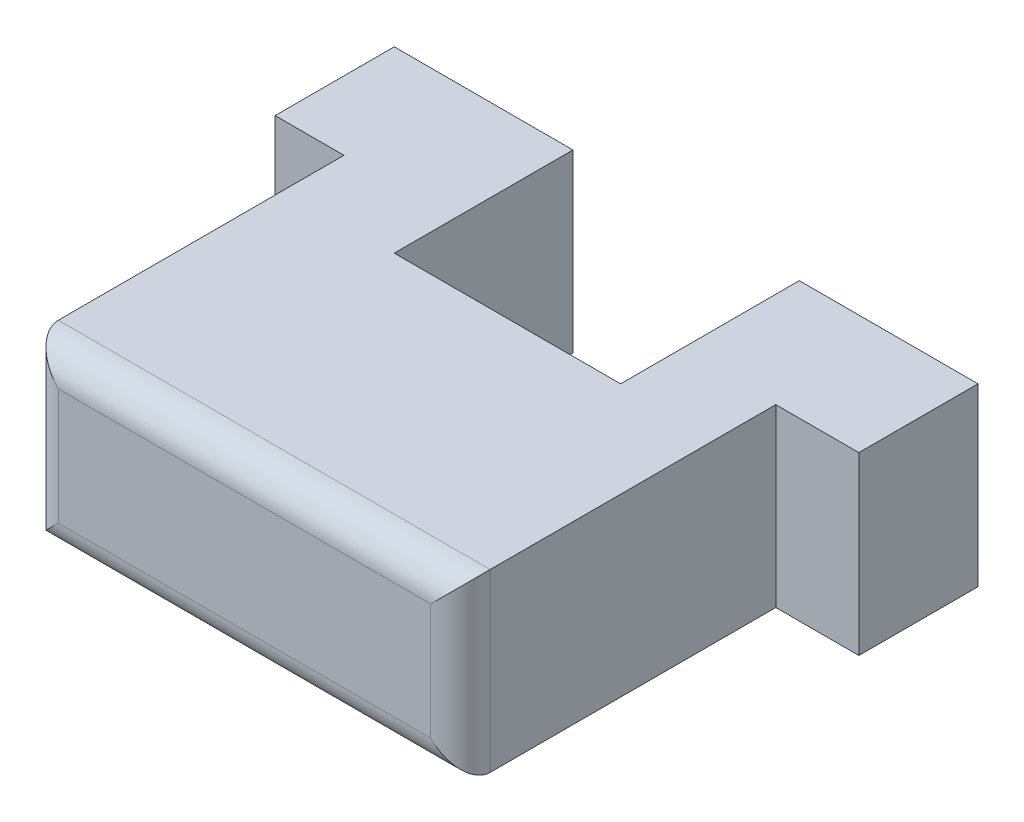
ISO-10303-21;
HEADER;
FILE_DESCRIPTION(('STEP AP214'),'2;1');
FILE_NAME('part.step','',(''),(''),'','','');
FILE_SCHEMA(('AUTOMOTIVE_DESIGN { 1 0 10303 214 1 1 1 1 }'));
ENDSEC;
DATA;
#1=APPLICATION_CONTEXT('core data for automotive mechanical design processes');
#2=APPLICATION_PROTOCOL_DEFINITION('international standard','automotive_design',2000,#1);
#3=PRODUCT_CONTEXT('',#1,'mechanical');
#4=PRODUCT('Part','Part','',(#3));
#5=PRODUCT_RELATED_PRODUCT_CATEGORY('part','',(#4));
#6=PRODUCT_DEFINITION_FORMATION('','',#4);
#7=PRODUCT_DEFINITION_CONTEXT('part definition',#1,'design');
#8=PRODUCT_DEFINITION('design','',#6,#7);
#9=PRODUCT_DEFINITION_SHAPE('','',#8);
#10=(LENGTH_UNIT() NAMED_UNIT(*) SI_UNIT(.MILLI.,.METRE.));
#11=(NAMED_UNIT(*) PLANE_ANGLE_UNIT() SI_UNIT($,.RADIAN.));
#12=(NAMED_UNIT(*) SI_UNIT($,.STERADIAN.) SOLID_ANGLE_UNIT());
#13=UNCERTAINTY_MEASURE_WITH_UNIT(LENGTH_MEASURE(1.E-05),#10,'distance_accuracy_value','');
#14=(GEOMETRIC_REPRESENTATION_CONTEXT(3) GLOBAL_UNCERTAINTY_ASSIGNED_CONTEXT((#13)) GLOBAL_UNIT_ASSIGNED_CONTEXT((#10,
#11,#12)) REPRESENTATION_CONTEXT('',''));
#15=CARTESIAN_POINT('',(0.,0.,0.));
#16=DIRECTION('',(0.,0.,1.));
#17=DIRECTION('',(1.,0.,0.));
#18=AXIS2_PLACEMENT_3D('',#15,#16,#17);
#19=CARTESIAN_POINT('',(6.25,0.,7.59));
#20=DIRECTION('',(0.,1.,0.));
#21=DIRECTION('',(0.,0.,1.));
#22=AXIS2_PLACEMENT_3D('',#19,#20,#21);
#23=CYLINDRICAL_SURFACE('',#22,1.);
#24=CARTESIAN_POINT('',(6.25,1.95,7.59));
#25=DIRECTION('',(-0.707106781186547,0.707106781186547,0.));
#26=DIRECTION('',(-0.707106781186547,-0.707106781186547,0.));
#27=AXIS2_PLACEMENT_3D('',#24,#25,#26);
#28=ELLIPSE('',#27,1.41421356237309,1.);
#29=CARTESIAN_POINT('',(6.25,1.95,8.59));
#30=VERTEX_POINT('',#29);
#31=CARTESIAN_POINT('',(7.25,2.95,7.59));
#32=VERTEX_POINT('',#31);
#33=EDGE_CURVE('E11',#30,#32,#28,.T.);
#34=ORIENTED_EDGE('',*,*,#33,.F.);
#35=DIRECTION('',(0.,1.,0.));
#36=VECTOR('',#35,1.);
#37=CARTESIAN_POINT('',(6.25,0.,8.59));
#38=LINE('',#37,#36);
#39=CARTESIAN_POINT('',(6.25,-1.95,8.59));
#40=VERTEX_POINT('',#39);
#41=EDGE_CURVE('E237',#40,#30,#38,.T.);
#42=ORIENTED_EDGE('',*,*,#41,.F.);
#43=CARTESIAN_POINT('',(6.25,-1.95,7.59));
#44=DIRECTION('',(0.707106781186547,0.707106781186547,0.));
#45=DIRECTION('',(-0.707106781186547,0.707106781186547,0.));
#46=AXIS2_PLACEMENT_3D('',#43,#44,#45);
#47=ELLIPSE('',#46,1.41421356237309,1.);
#48=CARTESIAN_POINT('',(7.25,-2.95,7.59));
#49=VERTEX_POINT('',#48);
#50=EDGE_CURVE('E39',#40,#49,#47,.T.);
#51=ORIENTED_EDGE('',*,*,#50,.T.);
#52=DIRECTION('',(0.,1.,0.));
#53=VECTOR('',#52,1.);
#54=CARTESIAN_POINT('',(7.25,2.95,7.59));
#55=LINE('',#54,#53);
#56=EDGE_CURVE('E260',#32,#49,#55,.F.);
#57=ORIENTED_EDGE('',*,*,#56,.F.);
#58=EDGE_LOOP('',(#34,#42,#51,#57));
#59=FACE_BOUND('',#58,.T.);
#60=ADVANCED_FACE('F32',(#59),#23,.T.);
#61=CARTESIAN_POINT('',(0.,-1.95,7.59));
#62=DIRECTION('',(-1.,0.,0.));
#63=DIRECTION('',(0.,0.,1.));
#64=AXIS2_PLACEMENT_3D('',#61,#62,#63);
#65=CYLINDRICAL_SURFACE('',#64,1.);
#66=ORIENTED_EDGE('',*,*,#50,.F.);
#67=DIRECTION('',(1.,0.,0.));
#68=VECTOR('',#67,1.);
#69=CARTESIAN_POINT('',(0.,-1.95,8.59));
#70=LINE('',#69,#68);
#71=CARTESIAN_POINT('',(-6.25,-1.95,8.59));
#72=VERTEX_POINT('',#71);
#73=EDGE_CURVE('E241',#72,#40,#70,.T.);
#74=ORIENTED_EDGE('',*,*,#73,.F.);
#75=CARTESIAN_POINT('',(-6.25,-1.95,7.59));
#76=DIRECTION('',(-0.707106781186547,0.707106781186547,0.));
#77=DIRECTION('',(-0.707106781186547,-0.707106781186547,0.));
#78=AXIS2_PLACEMENT_3D('',#75,#76,#77);
#79=ELLIPSE('',#78,1.41421356237309,1.);
#80=CARTESIAN_POINT('',(-7.25,-2.95,7.59));
#81=VERTEX_POINT('',#80);
#82=EDGE_CURVE('E53',#72,#81,#79,.F.);
#83=ORIENTED_EDGE('',*,*,#82,.T.);
#84=DIRECTION('',(1.,0.,0.));
#85=VECTOR('',#84,1.);
#86=CARTESIAN_POINT('',(0.,-2.95,7.59));
#87=LINE('',#86,#85);
#88=EDGE_CURVE('E258',#49,#81,#87,.F.);
#89=ORIENTED_EDGE('',*,*,#88,.F.);
#90=EDGE_LOOP('',(#66,#74,#83,#89));
#91=FACE_BOUND('',#90,.T.);
#92=ADVANCED_FACE('F307',(#91),#65,.T.);
#93=CARTESIAN_POINT('',(-6.25,0.,7.59));
#94=DIRECTION('',(0.,1.,0.));
#95=DIRECTION('',(0.,0.,1.));
#96=AXIS2_PLACEMENT_3D('',#93,#94,#95);
#97=CYLINDRICAL_SURFACE('',#96,1.);
#98=ORIENTED_EDGE('',*,*,#82,.F.);
#99=DIRECTION('',(0.,-1.,0.));
#100=VECTOR('',#99,1.);
#101=CARTESIAN_POINT('',(-6.25,0.,8.59));
#102=LINE('',#101,#100);
#103=CARTESIAN_POINT('',(-6.25,1.95,8.59));
#104=VERTEX_POINT('',#103);
#105=EDGE_CURVE('E245',#104,#72,#102,.T.);
#106=ORIENTED_EDGE('',*,*,#105,.F.);
#107=CARTESIAN_POINT('',(-6.25,1.95,7.59));
#108=DIRECTION('',(0.707106781186547,0.707106781186547,0.));
#109=DIRECTION('',(-0.707106781186547,0.707106781186547,0.));
#110=AXIS2_PLACEMENT_3D('',#107,#108,#109);
#111=ELLIPSE('',#110,1.41421356237309,1.);
#112=CARTESIAN_POINT('',(-7.25,2.95,7.59));
#113=VERTEX_POINT('',#112);
#114=EDGE_CURVE('E262',#104,#113,#111,.F.);
#115=ORIENTED_EDGE('',*,*,#114,.T.);
#116=DIRECTION('',(0.,-1.,0.));
#117=VECTOR('',#116,1.);
#118=CARTESIAN_POINT('',(-7.25,0.,7.59));
#119=LINE('',#118,#117);
#120=EDGE_CURVE('E255',#81,#113,#119,.F.);
#121=ORIENTED_EDGE('',*,*,#120,.F.);
#122=EDGE_LOOP('',(#98,#106,#115,#121));
#123=FACE_BOUND('',#122,.T.);
#124=ADVANCED_FACE('F267',(#123),#97,.T.);
#125=CARTESIAN_POINT('',(0.,1.95,7.59));
#126=DIRECTION('',(-1.,0.,0.));
#127=DIRECTION('',(0.,0.,1.));
#128=AXIS2_PLACEMENT_3D('',#125,#126,#127);
#129=CYLINDRICAL_SURFACE('',#128,1.);
#130=DIRECTION('',(-1.,0.,0.));
#131=VECTOR('',#130,1.);
#132=CARTESIAN_POINT('',(0.,1.95,8.59));
#133=LINE('',#132,#131);
#134=EDGE_CURVE('E250',#30,#104,#133,.T.);
#135=ORIENTED_EDGE('',*,*,#134,.F.);
#136=ORIENTED_EDGE('',*,*,#33,.T.);
#137=DIRECTION('',(-1.,0.,0.));
#138=VECTOR('',#137,1.);
#139=CARTESIAN_POINT('',(-7.25,2.95,7.59));
#140=LINE('',#139,#138);
#141=EDGE_CURVE('E252',#113,#32,#140,.F.);
#142=ORIENTED_EDGE('',*,*,#141,.F.);
#143=ORIENTED_EDGE('',*,*,#114,.F.);
#144=EDGE_LOOP('',(#135,#136,#142,#143));
#145=FACE_BOUND('',#144,.T.);
#146=ADVANCED_FACE('F274',(#145),#129,.T.);
#147=CARTESIAN_POINT('',(0.,0.,0.));
#148=DIRECTION('',(0.,0.,1.));
#149=DIRECTION('',(1.,0.,0.));
#150=AXIS2_PLACEMENT_3D('',#147,#148,#149);
#151=PLANE('',#150);
#152=DIRECTION('',(0.,-1.,0.));
#153=VECTOR('',#152,1.);
#154=CARTESIAN_POINT('',(-3.56007381756422,2.95,0.));
#155=LINE('',#154,#153);
#156=CARTESIAN_POINT('',(-3.56007381756422,2.95,0.));
#157=VERTEX_POINT('',#156);
#158=CARTESIAN_POINT('',(-3.56007381756423,-2.95,0.));
#159=VERTEX_POINT('',#158);
#160=EDGE_CURVE('E140',#157,#159,#155,.T.);
#161=ORIENTED_EDGE('',*,*,#160,.F.);
#162=DIRECTION('',(1.,0.,0.));
#163=VECTOR('',#162,1.);
#164=CARTESIAN_POINT('',(-7.25,2.95,0.));
#165=LINE('',#164,#163);
#166=CARTESIAN_POINT('',(4.03992618243578,2.95,0.));
#167=VERTEX_POINT('',#166);
#168=EDGE_CURVE('E226',#157,#167,#165,.T.);
#169=ORIENTED_EDGE('',*,*,#168,.T.);
#170=DIRECTION('',(0.,1.,0.));
#171=VECTOR('',#170,1.);
#172=CARTESIAN_POINT('',(4.03992618243578,2.95,0.));
#173=LINE('',#172,#171);
#174=CARTESIAN_POINT('',(4.03992618243577,-2.95,0.));
#175=VERTEX_POINT('',#174);
#176=EDGE_CURVE('E201',#175,#167,#173,.T.);
#177=ORIENTED_EDGE('',*,*,#176,.F.);
#178=DIRECTION('',(1.,0.,0.));
#179=VECTOR('',#178,1.);
#180=CARTESIAN_POINT('',(-7.25,-2.95,0.));
#181=LINE('',#180,#179);
#182=EDGE_CURVE('E223',#159,#175,#181,.T.);
#183=ORIENTED_EDGE('',*,*,#182,.F.);
#184=EDGE_LOOP('',(#161,#169,#177,#183));
#185=FACE_BOUND('',#184,.T.);
#186=ADVANCED_FACE('F289',(#185),#151,.F.);
#187=CARTESIAN_POINT('',(-7.25,2.95,2.59));
#188=DIRECTION('',(1.,0.,0.));
#189=DIRECTION('',(0.,0.,-1.));
#190=AXIS2_PLACEMENT_3D('',#187,#188,#189);
#191=PLANE('',#190);
#192=DIRECTION('',(0.,0.,-1.));
#193=VECTOR('',#192,1.);
#194=CARTESIAN_POINT('',(-7.25,-2.95,2.59));
#195=LINE('',#194,#193);
#196=CARTESIAN_POINT('',(-7.25,-2.95,-2.));
#197=VERTEX_POINT('',#196);
#198=EDGE_CURVE('E214',#81,#197,#195,.T.);
#199=ORIENTED_EDGE('',*,*,#198,.F.);
#200=ORIENTED_EDGE('',*,*,#120,.T.);
#201=DIRECTION('',(0.,0.,-1.));
#202=VECTOR('',#201,1.);
#203=CARTESIAN_POINT('',(-7.25,2.95,2.59));
#204=LINE('',#203,#202);
#205=CARTESIAN_POINT('',(-7.25,2.95,-2.));
#206=VERTEX_POINT('',#205);
#207=EDGE_CURVE('E228',#113,#206,#204,.T.);
#208=ORIENTED_EDGE('',*,*,#207,.T.);
#209=DIRECTION('',(0.,1.,0.));
#210=VECTOR('',#209,1.);
#211=CARTESIAN_POINT('',(-7.25,2.95,-2.));
#212=LINE('',#211,#210);
#213=EDGE_CURVE('E143',#197,#206,#212,.T.);
#214=ORIENTED_EDGE('',*,*,#213,.F.);
#215=EDGE_LOOP('',(#199,#200,#208,#214));
#216=FACE_BOUND('',#215,.T.);
#217=ADVANCED_FACE('F272',(#216),#191,.F.);
#218=CARTESIAN_POINT('',(-7.25,-2.95,2.59));
#219=DIRECTION('',(0.,1.,0.));
#220=DIRECTION('',(0.,0.,1.));
#221=AXIS2_PLACEMENT_3D('',#218,#219,#220);
#222=PLANE('',#221);
#223=DIRECTION('',(0.,0.,-1.));
#224=VECTOR('',#223,1.);
#225=CARTESIAN_POINT('',(7.25,-2.95,2.59));
#226=LINE('',#225,#224);
#227=CARTESIAN_POINT('',(7.25,-2.95,-2.));
#228=VERTEX_POINT('',#227);
#229=EDGE_CURVE('E234',#49,#228,#226,.T.);
#230=ORIENTED_EDGE('',*,*,#229,.F.);
#231=ORIENTED_EDGE('',*,*,#88,.T.);
#232=ORIENTED_EDGE('',*,*,#198,.T.);
#233=DIRECTION('',(-1.,0.,0.));
#234=VECTOR('',#233,1.);
#235=CARTESIAN_POINT('',(-3.56007381756423,-2.95,-2.));
#236=LINE('',#235,#234);
#237=CARTESIAN_POINT('',(-9.56007381756422,-2.95,-2.));
#238=VERTEX_POINT('',#237);
#239=EDGE_CURVE('E168',#197,#238,#236,.T.);
#240=ORIENTED_EDGE('',*,*,#239,.T.);
#241=DIRECTION('',(0.,0.,1.));
#242=VECTOR('',#241,1.);
#243=CARTESIAN_POINT('',(-9.56007381756422,-2.95,-6.));
#244=LINE('',#243,#242);
#245=CARTESIAN_POINT('',(-9.56007381756422,-2.95,-6.));
#246=VERTEX_POINT('',#245);
#247=EDGE_CURVE('E150',#246,#238,#244,.T.);
#248=ORIENTED_EDGE('',*,*,#247,.F.);
#249=DIRECTION('',(-1.,0.,0.));
#250=VECTOR('',#249,1.);
#251=CARTESIAN_POINT('',(-3.56007381756423,-2.95,-6.));
#252=LINE('',#251,#250);
#253=CARTESIAN_POINT('',(-3.56007381756423,-2.95,-6.));
#254=VERTEX_POINT('',#253);
#255=EDGE_CURVE('E146',#254,#246,#252,.T.);
#256=ORIENTED_EDGE('',*,*,#255,.F.);
#257=DIRECTION('',(0.,0.,1.));
#258=VECTOR('',#257,1.);
#259=CARTESIAN_POINT('',(-3.56007381756423,-2.95,-2.));
#260=LINE('',#259,#258);
#261=EDGE_CURVE('E133',#254,#159,#260,.T.);
#262=ORIENTED_EDGE('',*,*,#261,.T.);
#263=ORIENTED_EDGE('',*,*,#182,.T.);
#264=DIRECTION('',(0.,0.,1.));
#265=VECTOR('',#264,1.);
#266=CARTESIAN_POINT('',(4.03992618243578,-2.95,-2.));
#267=LINE('',#266,#265);
#268=CARTESIAN_POINT('',(4.03992618243578,-2.95,-6.));
#269=VERTEX_POINT('',#268);
#270=EDGE_CURVE('E218',#269,#175,#267,.T.);
#271=ORIENTED_EDGE('',*,*,#270,.F.);
#272=DIRECTION('',(-1.,0.,0.));
#273=VECTOR('',#272,1.);
#274=CARTESIAN_POINT('',(4.03992618243578,-2.95,-6.));
#275=LINE('',#274,#273);
#276=CARTESIAN_POINT('',(10.0399261824358,-2.95,-6.));
#277=VERTEX_POINT('',#276);
#278=EDGE_CURVE('E183',#277,#269,#275,.T.);
#279=ORIENTED_EDGE('',*,*,#278,.F.);
#280=DIRECTION('',(0.,0.,1.));
#281=VECTOR('',#280,1.);
#282=CARTESIAN_POINT('',(10.0399261824358,-2.95,-6.));
#283=LINE('',#282,#281);
#284=CARTESIAN_POINT('',(10.0399261824358,-2.95,-2.));
#285=VERTEX_POINT('',#284);
#286=EDGE_CURVE('E186',#277,#285,#283,.T.);
#287=ORIENTED_EDGE('',*,*,#286,.T.);
#288=DIRECTION('',(-1.,0.,0.));
#289=VECTOR('',#288,1.);
#290=CARTESIAN_POINT('',(4.03992618243578,-2.95,-2.));
#291=LINE('',#290,#289);
#292=EDGE_CURVE('E179',#285,#228,#291,.T.);
#293=ORIENTED_EDGE('',*,*,#292,.T.);
#294=EDGE_LOOP('',(#230,#231,#232,#240,#248,#256,#262,#263,#271,#279,#287,#293));
#295=FACE_BOUND('',#294,.T.);
#296=ADVANCED_FACE('F148',(#295),#222,.F.);
#297=CARTESIAN_POINT('',(7.25,2.95,2.59));
#298=DIRECTION('',(1.,0.,0.));
#299=DIRECTION('',(0.,0.,-1.));
#300=AXIS2_PLACEMENT_3D('',#297,#298,#299);
#301=PLANE('',#300);
#302=DIRECTION('',(0.,0.,-1.));
#303=VECTOR('',#302,1.);
#304=CARTESIAN_POINT('',(7.25,2.95,2.59));
#305=LINE('',#304,#303);
#306=CARTESIAN_POINT('',(7.25,2.95,-2.));
#307=VERTEX_POINT('',#306);
#308=EDGE_CURVE('E233',#32,#307,#305,.T.);
#309=ORIENTED_EDGE('',*,*,#308,.F.);
#310=ORIENTED_EDGE('',*,*,#56,.T.);
#311=ORIENTED_EDGE('',*,*,#229,.T.);
#312=DIRECTION('',(0.,-1.,0.));
#313=VECTOR('',#312,1.);
#314=CARTESIAN_POINT('',(7.25,2.95,-2.));
#315=LINE('',#314,#313);
#316=EDGE_CURVE('E202',#307,#228,#315,.T.);
#317=ORIENTED_EDGE('',*,*,#316,.F.);
#318=EDGE_LOOP('',(#309,#310,#311,#317));
#319=FACE_BOUND('',#318,.T.);
#320=ADVANCED_FACE('F306',(#319),#301,.T.);
#321=CARTESIAN_POINT('',(-7.25,2.95,2.59));
#322=DIRECTION('',(0.,1.,0.));
#323=DIRECTION('',(0.,0.,1.));
#324=AXIS2_PLACEMENT_3D('',#321,#322,#323);
#325=PLANE('',#324);
#326=ORIENTED_EDGE('',*,*,#207,.F.);
#327=ORIENTED_EDGE('',*,*,#141,.T.);
#328=ORIENTED_EDGE('',*,*,#308,.T.);
#329=DIRECTION('',(1.,0.,0.));
#330=VECTOR('',#329,1.);
#331=CARTESIAN_POINT('',(4.03992618243578,2.95,-2.));
#332=LINE('',#331,#330);
#333=CARTESIAN_POINT('',(10.0399261824358,2.95,-2.));
#334=VERTEX_POINT('',#333);
#335=EDGE_CURVE('E174',#307,#334,#332,.T.);
#336=ORIENTED_EDGE('',*,*,#335,.T.);
#337=DIRECTION('',(0.,0.,1.));
#338=VECTOR('',#337,1.);
#339=CARTESIAN_POINT('',(10.0399261824358,2.95,-6.));
#340=LINE('',#339,#338);
#341=CARTESIAN_POINT('',(10.0399261824358,2.95,-6.));
#342=VERTEX_POINT('',#341);
#343=EDGE_CURVE('E194',#342,#334,#340,.T.);
#344=ORIENTED_EDGE('',*,*,#343,.F.);
#345=DIRECTION('',(1.,0.,0.));
#346=VECTOR('',#345,1.);
#347=CARTESIAN_POINT('',(4.03992618243578,2.95,-6.));
#348=LINE('',#347,#346);
#349=CARTESIAN_POINT('',(4.03992618243578,2.95,-6.));
#350=VERTEX_POINT('',#349);
#351=EDGE_CURVE('E178',#350,#342,#348,.T.);
#352=ORIENTED_EDGE('',*,*,#351,.F.);
#353=DIRECTION('',(0.,0.,1.));
#354=VECTOR('',#353,1.);
#355=CARTESIAN_POINT('',(4.03992618243578,2.95,-2.));
#356=LINE('',#355,#354);
#357=EDGE_CURVE('E205',#350,#167,#356,.T.);
#358=ORIENTED_EDGE('',*,*,#357,.T.);
#359=ORIENTED_EDGE('',*,*,#168,.F.);
#360=DIRECTION('',(0.,0.,1.));
#361=VECTOR('',#360,1.);
#362=CARTESIAN_POINT('',(-3.56007381756422,2.95,-2.));
#363=LINE('',#362,#361);
#364=CARTESIAN_POINT('',(-3.56007381756422,2.95,-6.));
#365=VERTEX_POINT('',#364);
#366=EDGE_CURVE('E142',#365,#157,#363,.T.);
#367=ORIENTED_EDGE('',*,*,#366,.F.);
#368=DIRECTION('',(1.,0.,0.));
#369=VECTOR('',#368,1.);
#370=CARTESIAN_POINT('',(-3.56007381756422,2.95,-6.));
#371=LINE('',#370,#369);
#372=CARTESIAN_POINT('',(-9.56007381756422,2.95,-6.));
#373=VERTEX_POINT('',#372);
#374=EDGE_CURVE('E158',#373,#365,#371,.T.);
#375=ORIENTED_EDGE('',*,*,#374,.F.);
#376=DIRECTION('',(0.,0.,1.));
#377=VECTOR('',#376,1.);
#378=CARTESIAN_POINT('',(-9.56007381756422,2.95,-6.));
#379=LINE('',#378,#377);
#380=CARTESIAN_POINT('',(-9.56007381756422,2.95,-2.));
#381=VERTEX_POINT('',#380);
#382=EDGE_CURVE('E167',#373,#381,#379,.T.);
#383=ORIENTED_EDGE('',*,*,#382,.T.);
#384=DIRECTION('',(1.,0.,0.));
#385=VECTOR('',#384,1.);
#386=CARTESIAN_POINT('',(-3.56007381756422,2.95,-2.));
#387=LINE('',#386,#385);
#388=EDGE_CURVE('E159',#381,#206,#387,.T.);
#389=ORIENTED_EDGE('',*,*,#388,.T.);
#390=EDGE_LOOP('',(#326,#327,#328,#336,#344,#352,#358,#359,#367,#375,#383,#389));
#391=FACE_BOUND('',#390,.T.);
#392=ADVANCED_FACE('F277',(#391),#325,.T.);
#393=CARTESIAN_POINT('',(4.03992618243578,2.95,-2.));
#394=DIRECTION('',(1.,0.,0.));
#395=DIRECTION('',(0.,0.,-1.));
#396=AXIS2_PLACEMENT_3D('',#393,#394,#395);
#397=PLANE('',#396);
#398=ORIENTED_EDGE('',*,*,#176,.T.);
#399=ORIENTED_EDGE('',*,*,#357,.F.);
#400=DIRECTION('',(0.,1.,0.));
#401=VECTOR('',#400,1.);
#402=CARTESIAN_POINT('',(4.03992618243578,2.95,-6.));
#403=LINE('',#402,#401);
#404=EDGE_CURVE('E175',#269,#350,#403,.T.);
#405=ORIENTED_EDGE('',*,*,#404,.F.);
#406=ORIENTED_EDGE('',*,*,#270,.T.);
#407=EDGE_LOOP('',(#398,#399,#405,#406));
#408=FACE_BOUND('',#407,.T.);
#409=ADVANCED_FACE('F297',(#408),#397,.F.);
#410=CARTESIAN_POINT('',(-3.56007381756422,2.95,-2.));
#411=DIRECTION('',(-1.,0.,0.));
#412=DIRECTION('',(0.,-1.,0.));
#413=AXIS2_PLACEMENT_3D('',#410,#411,#412);
#414=PLANE('',#413);
#415=ORIENTED_EDGE('',*,*,#160,.T.);
#416=ORIENTED_EDGE('',*,*,#261,.F.);
#417=DIRECTION('',(0.,-1.,0.));
#418=VECTOR('',#417,1.);
#419=CARTESIAN_POINT('',(-3.56007381756422,2.95,-6.));
#420=LINE('',#419,#418);
#421=EDGE_CURVE('E138',#365,#254,#420,.T.);
#422=ORIENTED_EDGE('',*,*,#421,.F.);
#423=ORIENTED_EDGE('',*,*,#366,.T.);
#424=EDGE_LOOP('',(#415,#416,#422,#423));
#425=FACE_BOUND('',#424,.T.);
#426=ADVANCED_FACE('F135',(#425),#414,.F.);
#427=CARTESIAN_POINT('',(10.0399261824358,2.95,-6.));
#428=DIRECTION('',(-1.,0.,0.));
#429=DIRECTION('',(0.,0.,1.));
#430=AXIS2_PLACEMENT_3D('',#427,#428,#429);
#431=PLANE('',#430);
#432=DIRECTION('',(0.,-1.,0.));
#433=VECTOR('',#432,1.);
#434=CARTESIAN_POINT('',(10.0399261824358,2.95,-2.));
#435=LINE('',#434,#433);
#436=EDGE_CURVE('E188',#334,#285,#435,.T.);
#437=ORIENTED_EDGE('',*,*,#436,.T.);
#438=ORIENTED_EDGE('',*,*,#286,.F.);
#439=DIRECTION('',(0.,-1.,0.));
#440=VECTOR('',#439,1.);
#441=CARTESIAN_POINT('',(10.0399261824358,2.95,-6.));
#442=LINE('',#441,#440);
#443=EDGE_CURVE('E181',#342,#277,#442,.T.);
#444=ORIENTED_EDGE('',*,*,#443,.F.);
#445=ORIENTED_EDGE('',*,*,#343,.T.);
#446=EDGE_LOOP('',(#437,#438,#444,#445));
#447=FACE_BOUND('',#446,.T.);
#448=ADVANCED_FACE('F302',(#447),#431,.F.);
#449=CARTESIAN_POINT('',(0.,0.,-6.));
#450=DIRECTION('',(0.,0.,1.));
#451=DIRECTION('',(1.,0.,0.));
#452=AXIS2_PLACEMENT_3D('',#449,#450,#451);
#453=PLANE('',#452);
#454=ORIENTED_EDGE('',*,*,#404,.T.);
#455=ORIENTED_EDGE('',*,*,#351,.T.);
#456=ORIENTED_EDGE('',*,*,#443,.T.);
#457=ORIENTED_EDGE('',*,*,#278,.T.);
#458=EDGE_LOOP('',(#454,#455,#456,#457));
#459=FACE_BOUND('',#458,.T.);
#460=ADVANCED_FACE('F294',(#459),#453,.F.);
#461=CARTESIAN_POINT('',(0.,0.,-2.));
#462=DIRECTION('',(0.,0.,1.));
#463=DIRECTION('',(1.,0.,0.));
#464=AXIS2_PLACEMENT_3D('',#461,#462,#463);
#465=PLANE('',#464);
#466=ORIENTED_EDGE('',*,*,#335,.F.);
#467=ORIENTED_EDGE('',*,*,#316,.T.);
#468=ORIENTED_EDGE('',*,*,#292,.F.);
#469=ORIENTED_EDGE('',*,*,#436,.F.);
#470=EDGE_LOOP('',(#466,#467,#468,#469));
#471=FACE_BOUND('',#470,.T.);
#472=ADVANCED_FACE('F305',(#471),#465,.T.);
#473=CARTESIAN_POINT('',(0.,0.,-2.));
#474=DIRECTION('',(0.,0.,-1.));
#475=DIRECTION('',(-1.,0.,0.));
#476=AXIS2_PLACEMENT_3D('',#473,#474,#475);
#477=PLANE('',#476);
#478=ORIENTED_EDGE('',*,*,#239,.F.);
#479=ORIENTED_EDGE('',*,*,#213,.T.);
#480=ORIENTED_EDGE('',*,*,#388,.F.);
#481=DIRECTION('',(0.,1.,0.));
#482=VECTOR('',#481,1.);
#483=CARTESIAN_POINT('',(-9.56007381756422,2.95,-2.));
#484=LINE('',#483,#482);
#485=EDGE_CURVE('E162',#238,#381,#484,.T.);
#486=ORIENTED_EDGE('',*,*,#485,.F.);
#487=EDGE_LOOP('',(#478,#479,#480,#486));
#488=FACE_BOUND('',#487,.T.);
#489=ADVANCED_FACE('F283',(#488),#477,.F.);
#490=CARTESIAN_POINT('',(-9.56007381756422,2.95,-6.));
#491=DIRECTION('',(1.,0.,0.));
#492=DIRECTION('',(0.,0.,-1.));
#493=AXIS2_PLACEMENT_3D('',#490,#491,#492);
#494=PLANE('',#493);
#495=ORIENTED_EDGE('',*,*,#485,.T.);
#496=ORIENTED_EDGE('',*,*,#382,.F.);
#497=DIRECTION('',(0.,1.,0.));
#498=VECTOR('',#497,1.);
#499=CARTESIAN_POINT('',(-9.56007381756422,2.95,-6.));
#500=LINE('',#499,#498);
#501=EDGE_CURVE('E153',#246,#373,#500,.T.);
#502=ORIENTED_EDGE('',*,*,#501,.F.);
#503=ORIENTED_EDGE('',*,*,#247,.T.);
#504=EDGE_LOOP('',(#495,#496,#502,#503));
#505=FACE_BOUND('',#504,.T.);
#506=ADVANCED_FACE('F285',(#505),#494,.F.);
#507=CARTESIAN_POINT('',(0.,0.,-6.));
#508=DIRECTION('',(0.,0.,-1.));
#509=DIRECTION('',(-1.,0.,0.));
#510=AXIS2_PLACEMENT_3D('',#507,#508,#509);
#511=PLANE('',#510);
#512=ORIENTED_EDGE('',*,*,#421,.T.);
#513=ORIENTED_EDGE('',*,*,#255,.T.);
#514=ORIENTED_EDGE('',*,*,#501,.T.);
#515=ORIENTED_EDGE('',*,*,#374,.T.);
#516=EDGE_LOOP('',(#512,#513,#514,#515));
#517=FACE_BOUND('',#516,.T.);
#518=ADVANCED_FACE('F156',(#517),#511,.T.);
#519=CARTESIAN_POINT('',(0.,0.,8.59));
#520=DIRECTION('',(0.,0.,1.));
#521=DIRECTION('',(1.,0.,0.));
#522=AXIS2_PLACEMENT_3D('',#519,#520,#521);
#523=PLANE('',#522);
#524=ORIENTED_EDGE('',*,*,#41,.T.);
#525=ORIENTED_EDGE('',*,*,#134,.T.);
#526=ORIENTED_EDGE('',*,*,#105,.T.);
#527=ORIENTED_EDGE('',*,*,#73,.T.);
#528=EDGE_LOOP('',(#524,#525,#526,#527));
#529=FACE_BOUND('',#528,.T.);
#530=ADVANCED_FACE('F308',(#529),#523,.T.);
#531=CLOSED_SHELL('',(#60,#92,#124,#146,#186,#217,#296,#320,#392,#409,#426,#448,#460,#472,#489,
#506,#518,#530));
#532=MANIFOLD_SOLID_BREP('B2',#531);
#533=ADVANCED_BREP_SHAPE_REPRESENTATION('',(#18,#532),#14);
#534=SHAPE_DEFINITION_REPRESENTATION(#9,#533);
ENDSEC;
END-ISO-10303-21;
